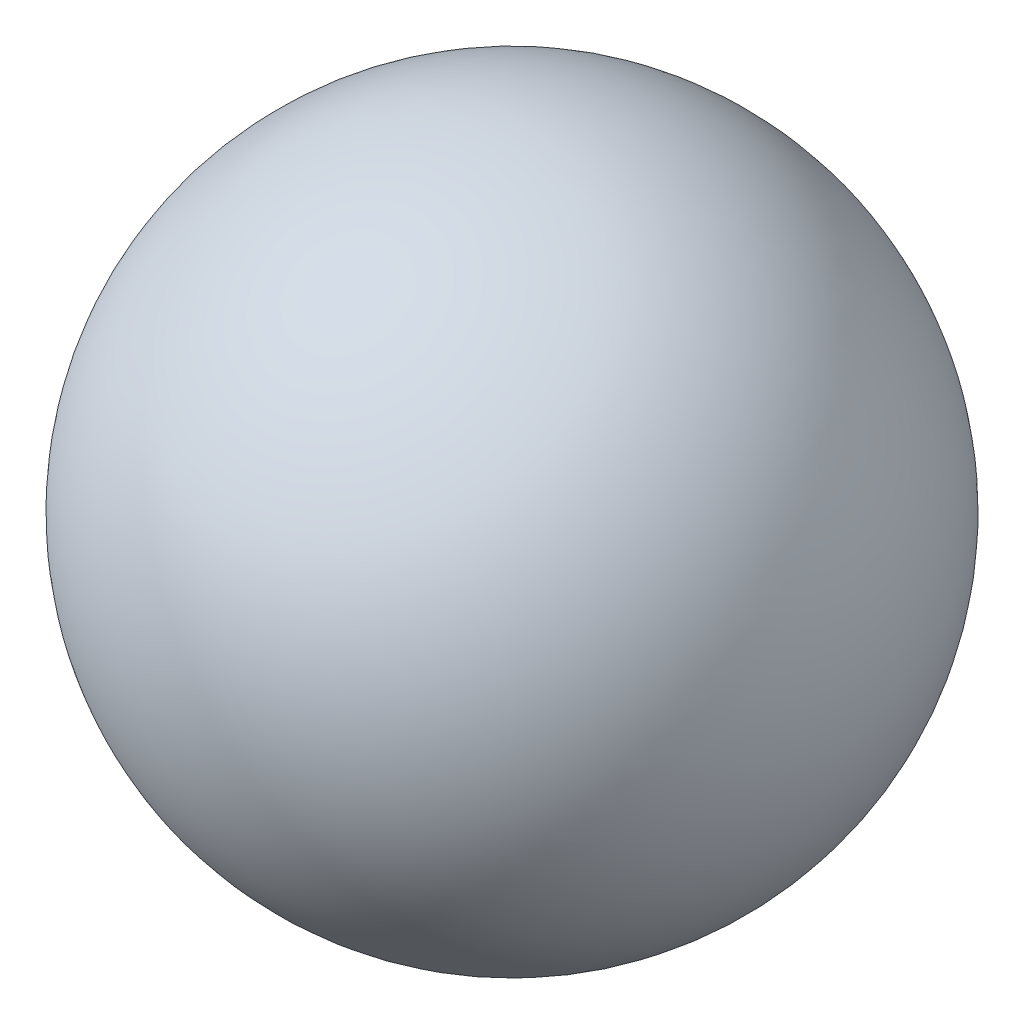
ISO-10303-21;
HEADER;
FILE_DESCRIPTION(('STEP AP214'),'2;1');
FILE_NAME('part.step','',(''),(''),'','','');
FILE_SCHEMA(('AUTOMOTIVE_DESIGN { 1 0 10303 214 1 1 1 1 }'));
ENDSEC;
DATA;
#1=APPLICATION_CONTEXT('core data for automotive mechanical design processes');
#2=APPLICATION_PROTOCOL_DEFINITION('international standard','automotive_design',2000,#1);
#3=PRODUCT_CONTEXT('',#1,'mechanical');
#4=PRODUCT('Part','Part','',(#3));
#5=PRODUCT_RELATED_PRODUCT_CATEGORY('part','',(#4));
#6=PRODUCT_DEFINITION_FORMATION('','',#4);
#7=PRODUCT_DEFINITION_CONTEXT('part definition',#1,'design');
#8=PRODUCT_DEFINITION('design','',#6,#7);
#9=PRODUCT_DEFINITION_SHAPE('','',#8);
#10=(LENGTH_UNIT() NAMED_UNIT(*) SI_UNIT(.MILLI.,.METRE.));
#11=(NAMED_UNIT(*) PLANE_ANGLE_UNIT() SI_UNIT($,.RADIAN.));
#12=(NAMED_UNIT(*) SI_UNIT($,.STERADIAN.) SOLID_ANGLE_UNIT());
#13=UNCERTAINTY_MEASURE_WITH_UNIT(LENGTH_MEASURE(1.E-05),#10,'distance_accuracy_value','');
#14=(GEOMETRIC_REPRESENTATION_CONTEXT(3) GLOBAL_UNCERTAINTY_ASSIGNED_CONTEXT((#13)) GLOBAL_UNIT_ASSIGNED_CONTEXT((#10,
#11,#12)) REPRESENTATION_CONTEXT('',''));
#15=CARTESIAN_POINT('',(0.,0.,0.));
#16=DIRECTION('',(0.,0.,1.));
#17=DIRECTION('',(1.,0.,0.));
#18=AXIS2_PLACEMENT_3D('',#15,#16,#17);
#19=CARTESIAN_POINT('',(-2.25386045473144,-3.,-7.67594378891598));
#20=DIRECTION('',(0.,0.,1.));
#21=DIRECTION('',(1.,0.,0.));
#22=AXIS2_PLACEMENT_3D('',#19,#20,#21);
#23=SPHERICAL_SURFACE('',#22,1.8);
#24=CARTESIAN_POINT('',(-2.25386045473144,-3.,-5.87594378891598));
#25=VERTEX_POINT('',#24);
#26=VERTEX_LOOP('',#25);
#27=FACE_BOUND('',#26,.T.);
#28=ADVANCED_FACE('F12',(#27),#23,.T.);
#29=CLOSED_SHELL('',(#28));
#30=MANIFOLD_SOLID_BREP('B1',#29);
#31=ADVANCED_BREP_SHAPE_REPRESENTATION('',(#18,#30),#14);
#32=SHAPE_DEFINITION_REPRESENTATION(#9,#31);
ENDSEC;
END-ISO-10303-21;
